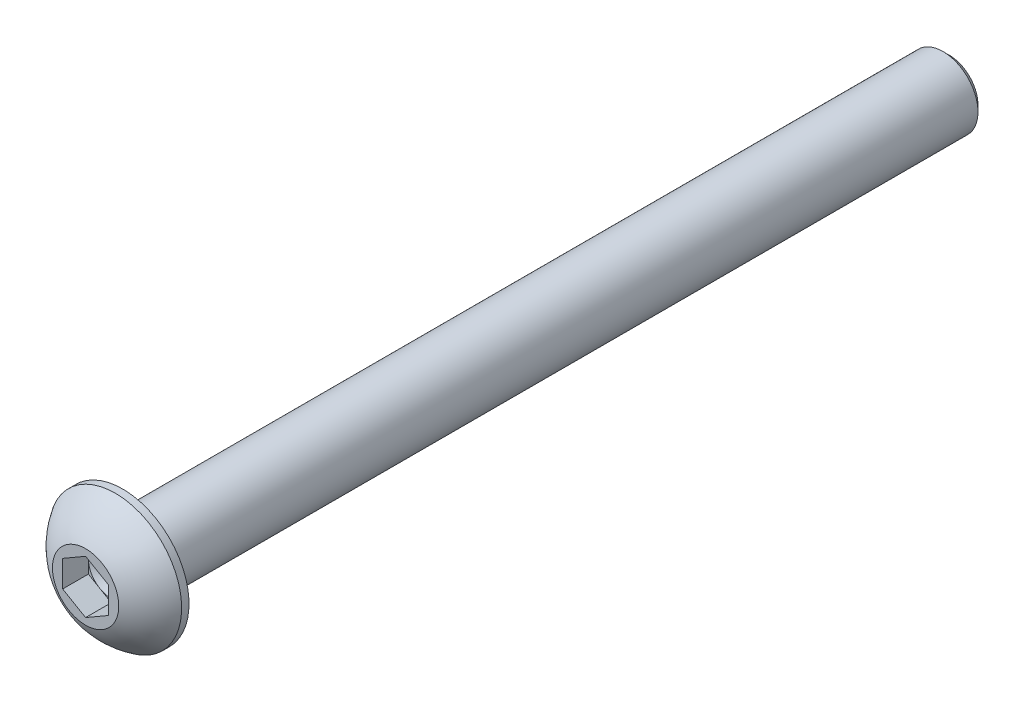
ISO-10303-21;
HEADER;
FILE_DESCRIPTION(('STEP AP214'),'2;1');
FILE_NAME('part.step','',(''),(''),'','','');
FILE_SCHEMA(('AUTOMOTIVE_DESIGN { 1 0 10303 214 1 1 1 1 }'));
ENDSEC;
DATA;
#1=APPLICATION_CONTEXT('core data for automotive mechanical design processes');
#2=APPLICATION_PROTOCOL_DEFINITION('international standard','automotive_design',2000,#1);
#3=PRODUCT_CONTEXT('',#1,'mechanical');
#4=PRODUCT('Part','Part','',(#3));
#5=PRODUCT_RELATED_PRODUCT_CATEGORY('part','',(#4));
#6=PRODUCT_DEFINITION_FORMATION('','',#4);
#7=PRODUCT_DEFINITION_CONTEXT('part definition',#1,'design');
#8=PRODUCT_DEFINITION('design','',#6,#7);
#9=PRODUCT_DEFINITION_SHAPE('','',#8);
#10=(LENGTH_UNIT() NAMED_UNIT(*) SI_UNIT(.MILLI.,.METRE.));
#11=(NAMED_UNIT(*) PLANE_ANGLE_UNIT() SI_UNIT($,.RADIAN.));
#12=(NAMED_UNIT(*) SI_UNIT($,.STERADIAN.) SOLID_ANGLE_UNIT());
#13=UNCERTAINTY_MEASURE_WITH_UNIT(LENGTH_MEASURE(1.E-05),#10,'distance_accuracy_value','');
#14=(GEOMETRIC_REPRESENTATION_CONTEXT(3) GLOBAL_UNCERTAINTY_ASSIGNED_CONTEXT((#13)) GLOBAL_UNIT_ASSIGNED_CONTEXT((#10,
#11,#12)) REPRESENTATION_CONTEXT('',''));
#15=CARTESIAN_POINT('',(0.,0.,0.));
#16=DIRECTION('',(0.,0.,1.));
#17=DIRECTION('',(1.,0.,0.));
#18=AXIS2_PLACEMENT_3D('',#15,#16,#17);
#19=CARTESIAN_POINT('',(0.,0.,-1.778));
#20=DIRECTION('',(0.,0.,1.));
#21=DIRECTION('',(1.,0.,0.));
#22=AXIS2_PLACEMENT_3D('',#19,#20,#21);
#23=PLANE('',#22);
#24=DIRECTION('',(0.,-1.,0.));
#25=VECTOR('',#24,1.);
#26=CARTESIAN_POINT('',(-1.5875,0.916543552338527,-1.778));
#27=LINE('',#26,#25);
#28=CARTESIAN_POINT('',(-1.5875,0.916543552338527,-1.778));
#29=VERTEX_POINT('',#28);
#30=CARTESIAN_POINT('',(-1.5875,0.,-1.778));
#31=VERTEX_POINT('',#30);
#32=EDGE_CURVE('E358',#29,#31,#27,.T.);
#33=ORIENTED_EDGE('',*,*,#32,.T.);
#34=CARTESIAN_POINT('',(0.,0.,-1.778));
#35=DIRECTION('',(0.,0.,-1.));
#36=DIRECTION('',(-1.,0.,0.));
#37=AXIS2_PLACEMENT_3D('',#34,#35,#36);
#38=CIRCLE('',#37,1.5875);
#39=CARTESIAN_POINT('',(-0.79375,1.37481532850779,-1.778));
#40=VERTEX_POINT('',#39);
#41=EDGE_CURVE('E60',#31,#40,#38,.T.);
#42=ORIENTED_EDGE('',*,*,#41,.T.);
#43=DIRECTION('',(-0.866025403784438,-0.500000000000001,0.));
#44=VECTOR('',#43,1.);
#45=CARTESIAN_POINT('',(0.,1.83308710467706,-1.778));
#46=LINE('',#45,#44);
#47=EDGE_CURVE('E347',#40,#29,#46,.T.);
#48=ORIENTED_EDGE('',*,*,#47,.T.);
#49=EDGE_LOOP('',(#33,#42,#48));
#50=FACE_BOUND('',#49,.T.);
#51=ADVANCED_FACE('F45',(#50),#23,.T.);
#52=CARTESIAN_POINT('',(0.,1.83308710467706,-1.778));
#53=VERTEX_POINT('',#52);
#54=EDGE_CURVE('E350',#53,#40,#46,.T.);
#55=ORIENTED_EDGE('',*,*,#54,.T.);
#56=CARTESIAN_POINT('',(0.793749999999998,1.3748153285078,-1.778));
#57=VERTEX_POINT('',#56);
#58=EDGE_CURVE('E219',#40,#57,#38,.T.);
#59=ORIENTED_EDGE('',*,*,#58,.T.);
#60=DIRECTION('',(-0.866025403784439,0.499999999999999,0.));
#61=VECTOR('',#60,1.);
#62=CARTESIAN_POINT('',(1.5875,0.916543552338531,-1.778));
#63=LINE('',#62,#61);
#64=EDGE_CURVE('E348',#57,#53,#63,.T.);
#65=ORIENTED_EDGE('',*,*,#64,.T.);
#66=EDGE_LOOP('',(#55,#59,#65));
#67=FACE_BOUND('',#66,.T.);
#68=ADVANCED_FACE('F134',(#67),#23,.T.);
#69=CARTESIAN_POINT('',(1.5875,0.916543552338531,-1.778));
#70=VERTEX_POINT('',#69);
#71=EDGE_CURVE('E341',#70,#57,#63,.T.);
#72=ORIENTED_EDGE('',*,*,#71,.T.);
#73=CARTESIAN_POINT('',(1.5875,0.,-1.778));
#74=VERTEX_POINT('',#73);
#75=EDGE_CURVE('E342',#57,#74,#38,.T.);
#76=ORIENTED_EDGE('',*,*,#75,.T.);
#77=DIRECTION('',(0.,1.,0.));
#78=VECTOR('',#77,1.);
#79=CARTESIAN_POINT('',(1.5875,-0.916543552338531,-1.778));
#80=LINE('',#79,#78);
#81=EDGE_CURVE('E344',#74,#70,#80,.T.);
#82=ORIENTED_EDGE('',*,*,#81,.T.);
#83=EDGE_LOOP('',(#72,#76,#82));
#84=FACE_BOUND('',#83,.T.);
#85=ADVANCED_FACE('F140',(#84),#23,.T.);
#86=CARTESIAN_POINT('',(1.5875,-0.916543552338531,-1.778));
#87=VERTEX_POINT('',#86);
#88=EDGE_CURVE('E352',#87,#74,#80,.T.);
#89=ORIENTED_EDGE('',*,*,#88,.T.);
#90=CARTESIAN_POINT('',(0.793749999999999,-1.37481532850779,-1.778));
#91=VERTEX_POINT('',#90);
#92=EDGE_CURVE('E401',#74,#91,#38,.T.);
#93=ORIENTED_EDGE('',*,*,#92,.T.);
#94=DIRECTION('',(0.866025403784439,0.5,0.));
#95=VECTOR('',#94,1.);
#96=CARTESIAN_POINT('',(0.,-1.83308710467706,-1.778));
#97=LINE('',#96,#95);
#98=EDGE_CURVE('E379',#91,#87,#97,.T.);
#99=ORIENTED_EDGE('',*,*,#98,.T.);
#100=EDGE_LOOP('',(#89,#93,#99));
#101=FACE_BOUND('',#100,.T.);
#102=ADVANCED_FACE('F193',(#101),#23,.T.);
#103=CARTESIAN_POINT('',(0.,-1.83308710467706,-1.778));
#104=VERTEX_POINT('',#103);
#105=EDGE_CURVE('E409',#104,#91,#97,.T.);
#106=ORIENTED_EDGE('',*,*,#105,.T.);
#107=CARTESIAN_POINT('',(-0.793749999999997,-1.3748153285078,-1.778));
#108=VERTEX_POINT('',#107);
#109=EDGE_CURVE('E402',#91,#108,#38,.T.);
#110=ORIENTED_EDGE('',*,*,#109,.T.);
#111=DIRECTION('',(0.866025403784439,-0.499999999999999,0.));
#112=VECTOR('',#111,1.);
#113=CARTESIAN_POINT('',(-1.5875,-0.916543552338531,-1.778));
#114=LINE('',#113,#112);
#115=EDGE_CURVE('E360',#108,#104,#114,.T.);
#116=ORIENTED_EDGE('',*,*,#115,.T.);
#117=EDGE_LOOP('',(#106,#110,#116));
#118=FACE_BOUND('',#117,.T.);
#119=ADVANCED_FACE('F132',(#118),#23,.T.);
#120=CARTESIAN_POINT('',(0.,0.,-4.85989606481481));
#121=DIRECTION('',(0.,0.,-1.));
#122=DIRECTION('',(1.,0.,0.));
#123=AXIS2_PLACEMENT_3D('',#120,#121,#122);
#124=SPHERICAL_SURFACE('',#123,5.37340285883187);
#125=CARTESIAN_POINT('',(0.,0.,0.));
#126=DIRECTION('',(0.,0.,-1.));
#127=DIRECTION('',(-1.,0.,0.));
#128=AXIS2_PLACEMENT_3D('',#125,#126,#127);
#129=CIRCLE('',#128,2.29235);
#130=CARTESIAN_POINT('',(-2.29235,0.,0.));
#131=VERTEX_POINT('',#130);
#132=EDGE_CURVE('E198',#131,#131,#129,.T.);
#133=ORIENTED_EDGE('',*,*,#132,.T.);
#134=EDGE_LOOP('',(#133));
#135=FACE_BOUND('',#134,.T.);
#136=CARTESIAN_POINT('',(0.,0.,-2.0574));
#137=DIRECTION('',(0.,0.,-1.));
#138=DIRECTION('',(-1.,0.,0.));
#139=AXIS2_PLACEMENT_3D('',#136,#137,#138);
#140=CIRCLE('',#139,4.5847);
#141=CARTESIAN_POINT('',(-4.5847,0.,-2.0574));
#142=VERTEX_POINT('',#141);
#143=EDGE_CURVE('E201',#142,#142,#140,.T.);
#144=ORIENTED_EDGE('',*,*,#143,.F.);
#145=EDGE_LOOP('',(#144));
#146=FACE_BOUND('',#145,.T.);
#147=ADVANCED_FACE('F183',(#135,#146),#124,.T.);
#148=CARTESIAN_POINT('',(2.29235,0.,0.));
#149=DIRECTION('',(0.,0.,1.));
#150=DIRECTION('',(1.,0.,0.));
#151=AXIS2_PLACEMENT_3D('',#148,#149,#150);
#152=PLANE('',#151);
#153=DIRECTION('',(0.866025403784439,0.5,0.));
#154=VECTOR('',#153,1.);
#155=CARTESIAN_POINT('',(0.,-1.83308710467706,0.));
#156=LINE('',#155,#154);
#157=CARTESIAN_POINT('',(0.,-1.83308710467706,0.));
#158=VERTEX_POINT('',#157);
#159=CARTESIAN_POINT('',(1.5875,-0.916543552338531,0.));
#160=VERTEX_POINT('',#159);
#161=EDGE_CURVE('E68',#158,#160,#156,.T.);
#162=ORIENTED_EDGE('',*,*,#161,.F.);
#163=DIRECTION('',(0.866025403784439,-0.499999999999999,0.));
#164=VECTOR('',#163,1.);
#165=CARTESIAN_POINT('',(-1.5875,-0.916543552338531,0.));
#166=LINE('',#165,#164);
#167=CARTESIAN_POINT('',(-1.5875,-0.916543552338531,0.));
#168=VERTEX_POINT('',#167);
#169=EDGE_CURVE('E377',#168,#158,#166,.T.);
#170=ORIENTED_EDGE('',*,*,#169,.F.);
#171=DIRECTION('',(0.,-1.,0.));
#172=VECTOR('',#171,1.);
#173=CARTESIAN_POINT('',(-1.5875,0.916543552338527,0.));
#174=LINE('',#173,#172);
#175=CARTESIAN_POINT('',(-1.5875,0.916543552338527,0.));
#176=VERTEX_POINT('',#175);
#177=EDGE_CURVE('E374',#176,#168,#174,.T.);
#178=ORIENTED_EDGE('',*,*,#177,.F.);
#179=DIRECTION('',(-0.866025403784438,-0.500000000000001,0.));
#180=VECTOR('',#179,1.);
#181=CARTESIAN_POINT('',(0.,1.83308710467706,0.));
#182=LINE('',#181,#180);
#183=CARTESIAN_POINT('',(0.,1.83308710467706,0.));
#184=VERTEX_POINT('',#183);
#185=EDGE_CURVE('E371',#184,#176,#182,.T.);
#186=ORIENTED_EDGE('',*,*,#185,.F.);
#187=DIRECTION('',(-0.866025403784439,0.499999999999999,0.));
#188=VECTOR('',#187,1.);
#189=CARTESIAN_POINT('',(1.5875,0.916543552338531,0.));
#190=LINE('',#189,#188);
#191=CARTESIAN_POINT('',(1.5875,0.916543552338531,0.));
#192=VERTEX_POINT('',#191);
#193=EDGE_CURVE('E368',#192,#184,#190,.T.);
#194=ORIENTED_EDGE('',*,*,#193,.F.);
#195=DIRECTION('',(0.,1.,0.));
#196=VECTOR('',#195,1.);
#197=CARTESIAN_POINT('',(1.5875,-0.916543552338531,0.));
#198=LINE('',#197,#196);
#199=EDGE_CURVE('E365',#160,#192,#198,.T.);
#200=ORIENTED_EDGE('',*,*,#199,.F.);
#201=EDGE_LOOP('',(#162,#170,#178,#186,#194,#200));
#202=FACE_BOUND('',#201,.T.);
#203=ORIENTED_EDGE('',*,*,#132,.F.);
#204=EDGE_LOOP('',(#203));
#205=FACE_BOUND('',#204,.T.);
#206=ADVANCED_FACE('F180',(#202,#205),#152,.T.);
#207=CARTESIAN_POINT('',(0.,0.,-2.5654));
#208=DIRECTION('',(0.,0.,-1.));
#209=DIRECTION('',(-1.,0.,0.));
#210=AXIS2_PLACEMENT_3D('',#207,#208,#209);
#211=PLANE('',#210);
#212=CARTESIAN_POINT('',(0.,0.,-2.5654));
#213=DIRECTION('',(0.,0.,-1.));
#214=DIRECTION('',(-1.,0.,0.));
#215=AXIS2_PLACEMENT_3D('',#212,#213,#214);
#216=CIRCLE('',#215,2.794);
#217=CARTESIAN_POINT('',(-2.794,0.,-2.5654));
#218=VERTEX_POINT('',#217);
#219=EDGE_CURVE('E11',#218,#218,#216,.F.);
#220=ORIENTED_EDGE('',*,*,#219,.T.);
#221=EDGE_LOOP('',(#220));
#222=FACE_BOUND('',#221,.T.);
#223=CARTESIAN_POINT('',(0.,0.,-2.5654));
#224=DIRECTION('',(0.,0.,-1.));
#225=DIRECTION('',(-1.,0.,0.));
#226=AXIS2_PLACEMENT_3D('',#223,#224,#225);
#227=CIRCLE('',#226,4.5847);
#228=CARTESIAN_POINT('',(-4.5847,0.,-2.5654));
#229=VERTEX_POINT('',#228);
#230=EDGE_CURVE('E202',#229,#229,#227,.T.);
#231=ORIENTED_EDGE('',*,*,#230,.T.);
#232=EDGE_LOOP('',(#231));
#233=FACE_BOUND('',#232,.T.);
#234=ADVANCED_FACE('F176',(#222,#233),#211,.T.);
#235=CARTESIAN_POINT('',(0.,0.,0.));
#236=DIRECTION('',(0.,0.,-1.));
#237=DIRECTION('',(-1.,0.,0.));
#238=AXIS2_PLACEMENT_3D('',#235,#236,#237);
#239=CYLINDRICAL_SURFACE('',#238,4.5847);
#240=ORIENTED_EDGE('',*,*,#143,.T.);
#241=EDGE_LOOP('',(#240));
#242=FACE_BOUND('',#241,.T.);
#243=ORIENTED_EDGE('',*,*,#230,.F.);
#244=EDGE_LOOP('',(#243));
#245=FACE_BOUND('',#244,.T.);
#246=ADVANCED_FACE('F172',(#242,#245),#239,.T.);
#247=CARTESIAN_POINT('',(0.,0.,-59.7154));
#248=DIRECTION('',(0.,0.,1.));
#249=DIRECTION('',(1.,0.,0.));
#250=AXIS2_PLACEMENT_3D('',#247,#248,#249);
#251=CYLINDRICAL_SURFACE('',#250,2.413);
#252=CARTESIAN_POINT('',(0.,0.,-2.9464));
#253=DIRECTION('',(0.,0.,-1.));
#254=DIRECTION('',(-1.,0.,0.));
#255=AXIS2_PLACEMENT_3D('',#252,#253,#254);
#256=CIRCLE('',#255,2.413);
#257=CARTESIAN_POINT('',(-2.413,0.,-2.9464));
#258=VERTEX_POINT('',#257);
#259=EDGE_CURVE('E53',#258,#258,#256,.T.);
#260=ORIENTED_EDGE('',*,*,#259,.T.);
#261=EDGE_LOOP('',(#260));
#262=FACE_BOUND('',#261,.T.);
#263=CARTESIAN_POINT('',(0.,0.,-59.28645761938));
#264=DIRECTION('',(0.,0.,-1.));
#265=DIRECTION('',(-1.,0.,0.));
#266=AXIS2_PLACEMENT_3D('',#263,#264,#265);
#267=CIRCLE('',#266,2.413);
#268=CARTESIAN_POINT('',(-2.413,0.,-59.28645761938));
#269=VERTEX_POINT('',#268);
#270=EDGE_CURVE('E218',#269,#269,#267,.F.);
#271=ORIENTED_EDGE('',*,*,#270,.T.);
#272=EDGE_LOOP('',(#271));
#273=FACE_BOUND('',#272,.T.);
#274=ADVANCED_FACE('F168',(#262,#273),#251,.T.);
#275=CARTESIAN_POINT('',(0.,0.,-59.7154));
#276=DIRECTION('',(0.,0.,-1.));
#277=DIRECTION('',(-1.,0.,0.));
#278=AXIS2_PLACEMENT_3D('',#275,#276,#277);
#279=PLANE('',#278);
#280=CARTESIAN_POINT('',(0.,0.,-59.7154));
#281=DIRECTION('',(0.,0.,-1.));
#282=DIRECTION('',(-1.,0.,0.));
#283=AXIS2_PLACEMENT_3D('',#280,#281,#282);
#284=CIRCLE('',#283,1.98405761937999);
#285=CARTESIAN_POINT('',(-1.98405761937999,0.,-59.7154));
#286=VERTEX_POINT('',#285);
#287=EDGE_CURVE('E215',#286,#286,#284,.T.);
#288=ORIENTED_EDGE('',*,*,#287,.T.);
#289=EDGE_LOOP('',(#288));
#290=FACE_BOUND('',#289,.T.);
#291=ADVANCED_FACE('F166',(#290),#279,.T.);
#292=CARTESIAN_POINT('',(0.,-1.83308710467706,-1.778));
#293=DIRECTION('',(0.5,-0.866025403784439,0.));
#294=DIRECTION('',(0.866025403784439,0.5,0.));
#295=AXIS2_PLACEMENT_3D('',#292,#293,#294);
#296=PLANE('',#295);
#297=ORIENTED_EDGE('',*,*,#161,.T.);
#298=DIRECTION('',(0.,0.,1.));
#299=VECTOR('',#298,1.);
#300=CARTESIAN_POINT('',(1.5875,-0.916543552338531,-1.778));
#301=LINE('',#300,#299);
#302=EDGE_CURVE('E210',#87,#160,#301,.T.);
#303=ORIENTED_EDGE('',*,*,#302,.F.);
#304=ORIENTED_EDGE('',*,*,#98,.F.);
#305=ORIENTED_EDGE('',*,*,#105,.F.);
#306=DIRECTION('',(0.,0.,1.));
#307=VECTOR('',#306,1.);
#308=CARTESIAN_POINT('',(0.,-1.83308710467706,-1.778));
#309=LINE('',#308,#307);
#310=EDGE_CURVE('E203',#104,#158,#309,.T.);
#311=ORIENTED_EDGE('',*,*,#310,.T.);
#312=EDGE_LOOP('',(#297,#303,#304,#305,#311));
#313=FACE_BOUND('',#312,.T.);
#314=ADVANCED_FACE('F148',(#313),#296,.F.);
#315=CARTESIAN_POINT('',(-1.5875,-0.916543552338531,-1.778));
#316=DIRECTION('',(-0.499999999999999,-0.866025403784439,0.));
#317=DIRECTION('',(0.866025403784439,-0.499999999999999,0.));
#318=AXIS2_PLACEMENT_3D('',#315,#316,#317);
#319=PLANE('',#318);
#320=ORIENTED_EDGE('',*,*,#169,.T.);
#321=ORIENTED_EDGE('',*,*,#310,.F.);
#322=ORIENTED_EDGE('',*,*,#115,.F.);
#323=CARTESIAN_POINT('',(-1.5875,-0.916543552338531,-1.778));
#324=VERTEX_POINT('',#323);
#325=EDGE_CURVE('E361',#324,#108,#114,.T.);
#326=ORIENTED_EDGE('',*,*,#325,.F.);
#327=DIRECTION('',(0.,0.,1.));
#328=VECTOR('',#327,1.);
#329=CARTESIAN_POINT('',(-1.5875,-0.916543552338531,-1.778));
#330=LINE('',#329,#328);
#331=EDGE_CURVE('E207',#324,#168,#330,.T.);
#332=ORIENTED_EDGE('',*,*,#331,.T.);
#333=EDGE_LOOP('',(#320,#321,#322,#326,#332));
#334=FACE_BOUND('',#333,.T.);
#335=ADVANCED_FACE('F144',(#334),#319,.F.);
#336=CARTESIAN_POINT('',(-1.5875,0.916543552338527,-1.778));
#337=DIRECTION('',(-1.,0.,0.));
#338=DIRECTION('',(0.,0.,1.));
#339=AXIS2_PLACEMENT_3D('',#336,#337,#338);
#340=PLANE('',#339);
#341=ORIENTED_EDGE('',*,*,#177,.T.);
#342=ORIENTED_EDGE('',*,*,#331,.F.);
#343=EDGE_CURVE('E357',#31,#324,#27,.T.);
#344=ORIENTED_EDGE('',*,*,#343,.F.);
#345=ORIENTED_EDGE('',*,*,#32,.F.);
#346=DIRECTION('',(0.,0.,1.));
#347=VECTOR('',#346,1.);
#348=CARTESIAN_POINT('',(-1.5875,0.916543552338527,-1.778));
#349=LINE('',#348,#347);
#350=EDGE_CURVE('E382',#29,#176,#349,.T.);
#351=ORIENTED_EDGE('',*,*,#350,.T.);
#352=EDGE_LOOP('',(#341,#342,#344,#345,#351));
#353=FACE_BOUND('',#352,.T.);
#354=ADVANCED_FACE('F147',(#353),#340,.F.);
#355=CARTESIAN_POINT('',(0.,1.83308710467706,-1.778));
#356=DIRECTION('',(-0.500000000000001,0.866025403784438,0.));
#357=DIRECTION('',(-0.866025403784438,-0.500000000000001,0.));
#358=AXIS2_PLACEMENT_3D('',#355,#356,#357);
#359=PLANE('',#358);
#360=ORIENTED_EDGE('',*,*,#185,.T.);
#361=ORIENTED_EDGE('',*,*,#350,.F.);
#362=ORIENTED_EDGE('',*,*,#47,.F.);
#363=ORIENTED_EDGE('',*,*,#54,.F.);
#364=DIRECTION('',(0.,0.,1.));
#365=VECTOR('',#364,1.);
#366=CARTESIAN_POINT('',(0.,1.83308710467706,-1.778));
#367=LINE('',#366,#365);
#368=EDGE_CURVE('E384',#53,#184,#367,.T.);
#369=ORIENTED_EDGE('',*,*,#368,.T.);
#370=EDGE_LOOP('',(#360,#361,#362,#363,#369));
#371=FACE_BOUND('',#370,.T.);
#372=ADVANCED_FACE('F152',(#371),#359,.F.);
#373=CARTESIAN_POINT('',(1.5875,0.916543552338531,-1.778));
#374=DIRECTION('',(0.499999999999999,0.866025403784439,0.));
#375=DIRECTION('',(-0.866025403784439,0.5,0.));
#376=AXIS2_PLACEMENT_3D('',#373,#374,#375);
#377=PLANE('',#376);
#378=ORIENTED_EDGE('',*,*,#193,.T.);
#379=ORIENTED_EDGE('',*,*,#368,.F.);
#380=ORIENTED_EDGE('',*,*,#64,.F.);
#381=ORIENTED_EDGE('',*,*,#71,.F.);
#382=DIRECTION('',(0.,0.,1.));
#383=VECTOR('',#382,1.);
#384=CARTESIAN_POINT('',(1.5875,0.916543552338531,-1.778));
#385=LINE('',#384,#383);
#386=EDGE_CURVE('E385',#70,#192,#385,.T.);
#387=ORIENTED_EDGE('',*,*,#386,.T.);
#388=EDGE_LOOP('',(#378,#379,#380,#381,#387));
#389=FACE_BOUND('',#388,.T.);
#390=ADVANCED_FACE('F156',(#389),#377,.F.);
#391=CARTESIAN_POINT('',(1.5875,-0.916543552338531,-1.778));
#392=DIRECTION('',(1.,0.,0.));
#393=DIRECTION('',(0.,0.,-1.));
#394=AXIS2_PLACEMENT_3D('',#391,#392,#393);
#395=PLANE('',#394);
#396=ORIENTED_EDGE('',*,*,#199,.T.);
#397=ORIENTED_EDGE('',*,*,#386,.F.);
#398=ORIENTED_EDGE('',*,*,#81,.F.);
#399=ORIENTED_EDGE('',*,*,#88,.F.);
#400=ORIENTED_EDGE('',*,*,#302,.T.);
#401=EDGE_LOOP('',(#396,#397,#398,#399,#400));
#402=FACE_BOUND('',#401,.T.);
#403=ADVANCED_FACE('F129',(#402),#395,.F.);
#404=ORIENTED_EDGE('',*,*,#325,.T.);
#405=EDGE_CURVE('E214',#108,#31,#38,.T.);
#406=ORIENTED_EDGE('',*,*,#405,.T.);
#407=ORIENTED_EDGE('',*,*,#343,.T.);
#408=EDGE_LOOP('',(#404,#406,#407));
#409=FACE_BOUND('',#408,.T.);
#410=ADVANCED_FACE('F121',(#409),#23,.T.);
#411=CARTESIAN_POINT('',(0.,0.,-2.69454355233853));
#412=DIRECTION('',(0.,0.,1.));
#413=DIRECTION('',(1.,0.,0.));
#414=AXIS2_PLACEMENT_3D('',#411,#412,#413);
#415=CONICAL_SURFACE('',#414,0.,1.0471975511966);
#416=ORIENTED_EDGE('',*,*,#41,.F.);
#417=ORIENTED_EDGE('',*,*,#405,.F.);
#418=ORIENTED_EDGE('',*,*,#109,.F.);
#419=ORIENTED_EDGE('',*,*,#92,.F.);
#420=ORIENTED_EDGE('',*,*,#75,.F.);
#421=ORIENTED_EDGE('',*,*,#58,.F.);
#422=EDGE_LOOP('',(#416,#417,#418,#419,#420,#421));
#423=FACE_BOUND('',#422,.T.);
#424=CARTESIAN_POINT('',(0.,0.,-2.69454355233853));
#425=VERTEX_POINT('',#424);
#426=VERTEX_LOOP('',#425);
#427=FACE_BOUND('',#426,.T.);
#428=ADVANCED_FACE('F118',(#423,#427),#415,.F.);
#429=CARTESIAN_POINT('',(0.,0.,-59.7154));
#430=DIRECTION('',(0.,0.,1.));
#431=DIRECTION('',(1.,0.,0.));
#432=AXIS2_PLACEMENT_3D('',#429,#430,#431);
#433=CONICAL_SURFACE('',#432,1.98405761937999,0.78539816339745);
#434=ORIENTED_EDGE('',*,*,#270,.F.);
#435=EDGE_LOOP('',(#434));
#436=FACE_BOUND('',#435,.T.);
#437=ORIENTED_EDGE('',*,*,#287,.F.);
#438=EDGE_LOOP('',(#437));
#439=FACE_BOUND('',#438,.T.);
#440=ADVANCED_FACE('F120',(#436,#439),#433,.T.);
#441=CARTESIAN_POINT('',(0.,0.,-2.9464));
#442=DIRECTION('',(0.,0.,-1.));
#443=DIRECTION('',(-1.,0.,0.));
#444=AXIS2_PLACEMENT_3D('',#441,#442,#443);
#445=TOROIDAL_SURFACE('',#444,2.794,0.381);
#446=ORIENTED_EDGE('',*,*,#219,.F.);
#447=EDGE_LOOP('',(#446));
#448=FACE_BOUND('',#447,.T.);
#449=ORIENTED_EDGE('',*,*,#259,.F.);
#450=EDGE_LOOP('',(#449));
#451=FACE_BOUND('',#450,.T.);
#452=ADVANCED_FACE('F47',(#448,#451),#445,.F.);
#453=CLOSED_SHELL('',(#51,#68,#85,#102,#119,#147,#206,#234,#246,#274,#291,#314,#335,#354,#372,
#390,#403,#410,#428,#440,#452));
#454=MANIFOLD_SOLID_BREP('B2',#453);
#455=ADVANCED_BREP_SHAPE_REPRESENTATION('',(#18,#454),#14);
#456=SHAPE_DEFINITION_REPRESENTATION(#9,#455);
ENDSEC;
END-ISO-10303-21;
